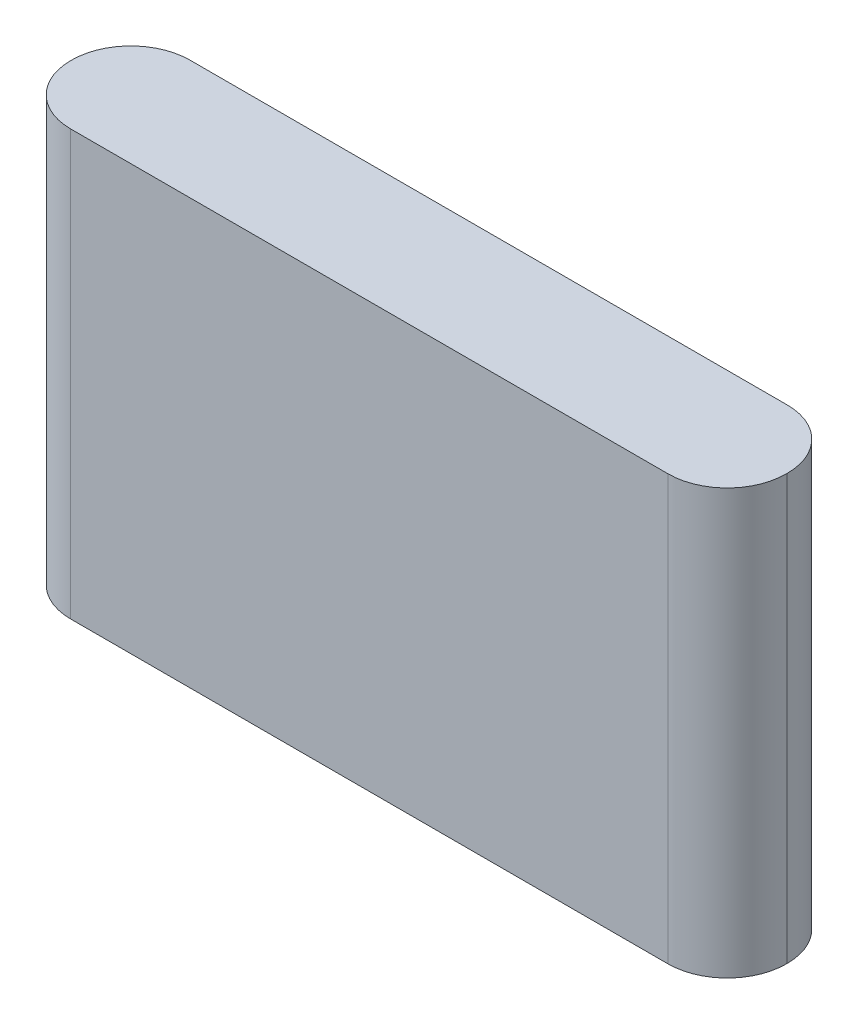
ISO-10303-21;
HEADER;
FILE_DESCRIPTION(('STEP AP214'),'2;1');
FILE_NAME('part.step','',(''),(''),'','','');
FILE_SCHEMA(('AUTOMOTIVE_DESIGN { 1 0 10303 214 1 1 1 1 }'));
ENDSEC;
DATA;
#1=APPLICATION_CONTEXT('core data for automotive mechanical design processes');
#2=APPLICATION_PROTOCOL_DEFINITION('international standard','automotive_design',2000,#1);
#3=PRODUCT_CONTEXT('',#1,'mechanical');
#4=PRODUCT('Part','Part','',(#3));
#5=PRODUCT_RELATED_PRODUCT_CATEGORY('part','',(#4));
#6=PRODUCT_DEFINITION_FORMATION('','',#4);
#7=PRODUCT_DEFINITION_CONTEXT('part definition',#1,'design');
#8=PRODUCT_DEFINITION('design','',#6,#7);
#9=PRODUCT_DEFINITION_SHAPE('','',#8);
#10=(LENGTH_UNIT() NAMED_UNIT(*) SI_UNIT(.MILLI.,.METRE.));
#11=(NAMED_UNIT(*) PLANE_ANGLE_UNIT() SI_UNIT($,.RADIAN.));
#12=(NAMED_UNIT(*) SI_UNIT($,.STERADIAN.) SOLID_ANGLE_UNIT());
#13=UNCERTAINTY_MEASURE_WITH_UNIT(LENGTH_MEASURE(1.E-05),#10,'distance_accuracy_value','');
#14=(GEOMETRIC_REPRESENTATION_CONTEXT(3) GLOBAL_UNCERTAINTY_ASSIGNED_CONTEXT((#13)) GLOBAL_UNIT_ASSIGNED_CONTEXT((#10,
#11,#12)) REPRESENTATION_CONTEXT('',''));
#15=CARTESIAN_POINT('',(0.,0.,0.));
#16=DIRECTION('',(0.,0.,1.));
#17=DIRECTION('',(1.,0.,0.));
#18=AXIS2_PLACEMENT_3D('',#15,#16,#17);
#19=CARTESIAN_POINT('',(43.,51.,-7.165));
#20=DIRECTION('',(-1.,0.,0.));
#21=DIRECTION('',(0.,0.,1.));
#22=AXIS2_PLACEMENT_3D('',#19,#20,#21);
#23=PLANE('',#22);
#24=DIRECTION('',(0.,0.,-1.));
#25=VECTOR('',#24,1.);
#26=CARTESIAN_POINT('',(43.,0.,-7.165));
#27=LINE('',#26,#25);
#28=CARTESIAN_POINT('',(43.,0.,0.0649999999999982));
#29=VERTEX_POINT('',#28);
#30=CARTESIAN_POINT('',(43.,0.,-0.0650000000000034));
#31=VERTEX_POINT('',#30);
#32=EDGE_CURVE('E131',#29,#31,#27,.T.);
#33=ORIENTED_EDGE('',*,*,#32,.T.);
#34=DIRECTION('',(0.,-1.,0.));
#35=VECTOR('',#34,1.);
#36=CARTESIAN_POINT('',(43.,51.,-0.0650000000000034));
#37=LINE('',#36,#35);
#38=CARTESIAN_POINT('',(43.,51.,-0.0650000000000034));
#39=VERTEX_POINT('',#38);
#40=EDGE_CURVE('E108',#31,#39,#37,.F.);
#41=ORIENTED_EDGE('',*,*,#40,.T.);
#42=DIRECTION('',(0.,0.,-1.));
#43=VECTOR('',#42,1.);
#44=CARTESIAN_POINT('',(43.,51.,-7.165));
#45=LINE('',#44,#43);
#46=CARTESIAN_POINT('',(43.,51.,0.0649999999999982));
#47=VERTEX_POINT('',#46);
#48=EDGE_CURVE('E140',#47,#39,#45,.T.);
#49=ORIENTED_EDGE('',*,*,#48,.F.);
#50=DIRECTION('',(0.,-1.,0.));
#51=VECTOR('',#50,1.);
#52=CARTESIAN_POINT('',(43.,51.,0.0649999999999982));
#53=LINE('',#52,#51);
#54=EDGE_CURVE('E113',#47,#29,#53,.T.);
#55=ORIENTED_EDGE('',*,*,#54,.T.);
#56=EDGE_LOOP('',(#33,#41,#49,#55));
#57=FACE_BOUND('',#56,.T.);
#58=ADVANCED_FACE('F36',(#57),#23,.F.);
#59=CARTESIAN_POINT('',(-43.,51.,-7.165));
#60=DIRECTION('',(0.,0.,1.));
#61=DIRECTION('',(1.,0.,0.));
#62=AXIS2_PLACEMENT_3D('',#59,#60,#61);
#63=PLANE('',#62);
#64=DIRECTION('',(-1.,0.,0.));
#65=VECTOR('',#64,1.);
#66=CARTESIAN_POINT('',(-43.,51.,-7.165));
#67=LINE('',#66,#65);
#68=CARTESIAN_POINT('',(35.9,51.,-7.165));
#69=VERTEX_POINT('',#68);
#70=CARTESIAN_POINT('',(-35.9,51.,-7.165));
#71=VERTEX_POINT('',#70);
#72=EDGE_CURVE('E123',#69,#71,#67,.T.);
#73=ORIENTED_EDGE('',*,*,#72,.F.);
#74=DIRECTION('',(0.,-1.,0.));
#75=VECTOR('',#74,1.);
#76=CARTESIAN_POINT('',(35.9,51.,-7.165));
#77=LINE('',#76,#75);
#78=CARTESIAN_POINT('',(35.9,0.,-7.165));
#79=VERTEX_POINT('',#78);
#80=EDGE_CURVE('E107',#69,#79,#77,.T.);
#81=ORIENTED_EDGE('',*,*,#80,.T.);
#82=DIRECTION('',(-1.,0.,0.));
#83=VECTOR('',#82,1.);
#84=CARTESIAN_POINT('',(-43.,0.,-7.165));
#85=LINE('',#84,#83);
#86=CARTESIAN_POINT('',(-35.9,0.,-7.165));
#87=VERTEX_POINT('',#86);
#88=EDGE_CURVE('E120',#79,#87,#85,.T.);
#89=ORIENTED_EDGE('',*,*,#88,.T.);
#90=DIRECTION('',(0.,-1.,0.));
#91=VECTOR('',#90,1.);
#92=CARTESIAN_POINT('',(-35.9,51.,-7.165));
#93=LINE('',#92,#91);
#94=EDGE_CURVE('E125',#87,#71,#93,.F.);
#95=ORIENTED_EDGE('',*,*,#94,.T.);
#96=EDGE_LOOP('',(#73,#81,#89,#95));
#97=FACE_BOUND('',#96,.T.);
#98=ADVANCED_FACE('F119',(#97),#63,.F.);
#99=CARTESIAN_POINT('',(-43.,51.,-7.165));
#100=DIRECTION('',(1.,0.,0.));
#101=DIRECTION('',(0.,0.,-1.));
#102=AXIS2_PLACEMENT_3D('',#99,#100,#101);
#103=PLANE('',#102);
#104=DIRECTION('',(0.,0.,1.));
#105=VECTOR('',#104,1.);
#106=CARTESIAN_POINT('',(-43.,51.,-7.165));
#107=LINE('',#106,#105);
#108=CARTESIAN_POINT('',(-43.,51.,-0.0649999999999965));
#109=VERTEX_POINT('',#108);
#110=CARTESIAN_POINT('',(-43.,51.,0.0650000000000052));
#111=VERTEX_POINT('',#110);
#112=EDGE_CURVE('E163',#109,#111,#107,.T.);
#113=ORIENTED_EDGE('',*,*,#112,.F.);
#114=DIRECTION('',(0.,-1.,0.));
#115=VECTOR('',#114,1.);
#116=CARTESIAN_POINT('',(-43.,51.,-0.0649999999999965));
#117=LINE('',#116,#115);
#118=CARTESIAN_POINT('',(-43.,0.,-0.0649999999999965));
#119=VERTEX_POINT('',#118);
#120=EDGE_CURVE('E11',#109,#119,#117,.T.);
#121=ORIENTED_EDGE('',*,*,#120,.T.);
#122=DIRECTION('',(0.,0.,1.));
#123=VECTOR('',#122,1.);
#124=CARTESIAN_POINT('',(-43.,0.,-7.165));
#125=LINE('',#124,#123);
#126=CARTESIAN_POINT('',(-43.,0.,0.0650000000000052));
#127=VERTEX_POINT('',#126);
#128=EDGE_CURVE('E130',#119,#127,#125,.T.);
#129=ORIENTED_EDGE('',*,*,#128,.T.);
#130=DIRECTION('',(0.,-1.,0.));
#131=VECTOR('',#130,1.);
#132=CARTESIAN_POINT('',(-43.,51.,0.0650000000000052));
#133=LINE('',#132,#131);
#134=EDGE_CURVE('E44',#127,#111,#133,.F.);
#135=ORIENTED_EDGE('',*,*,#134,.T.);
#136=EDGE_LOOP('',(#113,#121,#129,#135));
#137=FACE_BOUND('',#136,.T.);
#138=ADVANCED_FACE('F162',(#137),#103,.F.);
#139=CARTESIAN_POINT('',(-43.,51.,7.165));
#140=DIRECTION('',(0.,0.,-1.));
#141=DIRECTION('',(-1.,0.,0.));
#142=AXIS2_PLACEMENT_3D('',#139,#140,#141);
#143=PLANE('',#142);
#144=DIRECTION('',(1.,0.,0.));
#145=VECTOR('',#144,1.);
#146=CARTESIAN_POINT('',(-43.,0.,7.165));
#147=LINE('',#146,#145);
#148=CARTESIAN_POINT('',(-35.9,0.,7.165));
#149=VERTEX_POINT('',#148);
#150=CARTESIAN_POINT('',(35.9,0.,7.165));
#151=VERTEX_POINT('',#150);
#152=EDGE_CURVE('E134',#149,#151,#147,.T.);
#153=ORIENTED_EDGE('',*,*,#152,.T.);
#154=DIRECTION('',(0.,-1.,0.));
#155=VECTOR('',#154,1.);
#156=CARTESIAN_POINT('',(35.9,51.,7.165));
#157=LINE('',#156,#155);
#158=CARTESIAN_POINT('',(35.9,51.,7.165));
#159=VERTEX_POINT('',#158);
#160=EDGE_CURVE('E51',#151,#159,#157,.F.);
#161=ORIENTED_EDGE('',*,*,#160,.T.);
#162=DIRECTION('',(1.,0.,0.));
#163=VECTOR('',#162,1.);
#164=CARTESIAN_POINT('',(-43.,51.,7.165));
#165=LINE('',#164,#163);
#166=CARTESIAN_POINT('',(-35.9,51.,7.165));
#167=VERTEX_POINT('',#166);
#168=EDGE_CURVE('E141',#167,#159,#165,.T.);
#169=ORIENTED_EDGE('',*,*,#168,.F.);
#170=DIRECTION('',(0.,-1.,0.));
#171=VECTOR('',#170,1.);
#172=CARTESIAN_POINT('',(-35.9,51.,7.165));
#173=LINE('',#172,#171);
#174=EDGE_CURVE('E156',#167,#149,#173,.T.);
#175=ORIENTED_EDGE('',*,*,#174,.T.);
#176=EDGE_LOOP('',(#153,#161,#169,#175));
#177=FACE_BOUND('',#176,.T.);
#178=ADVANCED_FACE('F172',(#177),#143,.F.);
#179=CARTESIAN_POINT('',(0.,51.,0.));
#180=DIRECTION('',(0.,1.,0.));
#181=DIRECTION('',(0.,0.,1.));
#182=AXIS2_PLACEMENT_3D('',#179,#180,#181);
#183=PLANE('',#182);
#184=ORIENTED_EDGE('',*,*,#48,.T.);
#185=CARTESIAN_POINT('',(35.9,51.,-0.0649999999999999));
#186=DIRECTION('',(0.,1.,0.));
#187=DIRECTION('',(0.,0.,1.));
#188=AXIS2_PLACEMENT_3D('',#185,#186,#187);
#189=CIRCLE('',#188,7.1);
#190=EDGE_CURVE('E154',#39,#69,#189,.T.);
#191=ORIENTED_EDGE('',*,*,#190,.T.);
#192=ORIENTED_EDGE('',*,*,#72,.T.);
#193=CARTESIAN_POINT('',(-35.9,51.,-0.0649999999999999));
#194=DIRECTION('',(0.,1.,0.));
#195=DIRECTION('',(0.,0.,1.));
#196=AXIS2_PLACEMENT_3D('',#193,#194,#195);
#197=CIRCLE('',#196,7.1);
#198=EDGE_CURVE('E150',#71,#109,#197,.T.);
#199=ORIENTED_EDGE('',*,*,#198,.T.);
#200=ORIENTED_EDGE('',*,*,#112,.T.);
#201=CARTESIAN_POINT('',(-35.9,51.,0.0650000000000017));
#202=DIRECTION('',(0.,1.,0.));
#203=DIRECTION('',(0.,0.,1.));
#204=AXIS2_PLACEMENT_3D('',#201,#202,#203);
#205=CIRCLE('',#204,7.1);
#206=EDGE_CURVE('E58',#111,#167,#205,.T.);
#207=ORIENTED_EDGE('',*,*,#206,.T.);
#208=ORIENTED_EDGE('',*,*,#168,.T.);
#209=CARTESIAN_POINT('',(35.9,51.,0.0650000000000017));
#210=DIRECTION('',(0.,1.,0.));
#211=DIRECTION('',(0.,0.,1.));
#212=AXIS2_PLACEMENT_3D('',#209,#210,#211);
#213=CIRCLE('',#212,7.1);
#214=EDGE_CURVE('E152',#159,#47,#213,.T.);
#215=ORIENTED_EDGE('',*,*,#214,.T.);
#216=EDGE_LOOP('',(#184,#191,#192,#199,#200,#207,#208,#215));
#217=FACE_BOUND('',#216,.T.);
#218=ADVANCED_FACE('F167',(#217),#183,.T.);
#219=CARTESIAN_POINT('',(0.,0.,0.));
#220=DIRECTION('',(0.,1.,0.));
#221=DIRECTION('',(0.,0.,1.));
#222=AXIS2_PLACEMENT_3D('',#219,#220,#221);
#223=PLANE('',#222);
#224=ORIENTED_EDGE('',*,*,#88,.F.);
#225=CARTESIAN_POINT('',(35.9,0.,-0.0649999999999999));
#226=DIRECTION('',(0.,1.,0.));
#227=DIRECTION('',(0.,0.,1.));
#228=AXIS2_PLACEMENT_3D('',#225,#226,#227);
#229=CIRCLE('',#228,7.1);
#230=EDGE_CURVE('E103',#79,#31,#229,.F.);
#231=ORIENTED_EDGE('',*,*,#230,.T.);
#232=ORIENTED_EDGE('',*,*,#32,.F.);
#233=CARTESIAN_POINT('',(35.9,0.,0.0650000000000017));
#234=DIRECTION('',(0.,1.,0.));
#235=DIRECTION('',(0.,0.,1.));
#236=AXIS2_PLACEMENT_3D('',#233,#234,#235);
#237=CIRCLE('',#236,7.1);
#238=EDGE_CURVE('E114',#29,#151,#237,.F.);
#239=ORIENTED_EDGE('',*,*,#238,.T.);
#240=ORIENTED_EDGE('',*,*,#152,.F.);
#241=CARTESIAN_POINT('',(-35.9,0.,0.0650000000000017));
#242=DIRECTION('',(0.,1.,0.));
#243=DIRECTION('',(0.,0.,1.));
#244=AXIS2_PLACEMENT_3D('',#241,#242,#243);
#245=CIRCLE('',#244,7.1);
#246=EDGE_CURVE('E124',#149,#127,#245,.F.);
#247=ORIENTED_EDGE('',*,*,#246,.T.);
#248=ORIENTED_EDGE('',*,*,#128,.F.);
#249=CARTESIAN_POINT('',(-35.9,0.,-0.0649999999999999));
#250=DIRECTION('',(0.,1.,0.));
#251=DIRECTION('',(0.,0.,1.));
#252=AXIS2_PLACEMENT_3D('',#249,#250,#251);
#253=CIRCLE('',#252,7.1);
#254=EDGE_CURVE('E129',#119,#87,#253,.F.);
#255=ORIENTED_EDGE('',*,*,#254,.T.);
#256=EDGE_LOOP('',(#224,#231,#232,#239,#240,#247,#248,#255));
#257=FACE_BOUND('',#256,.T.);
#258=ADVANCED_FACE('F127',(#257),#223,.F.);
#259=CARTESIAN_POINT('',(35.9,51.,-0.0649999999999999));
#260=DIRECTION('',(0.,-1.,0.));
#261=DIRECTION('',(0.,0.,-1.));
#262=AXIS2_PLACEMENT_3D('',#259,#260,#261);
#263=CYLINDRICAL_SURFACE('',#262,7.1);
#264=ORIENTED_EDGE('',*,*,#190,.F.);
#265=ORIENTED_EDGE('',*,*,#40,.F.);
#266=ORIENTED_EDGE('',*,*,#230,.F.);
#267=ORIENTED_EDGE('',*,*,#80,.F.);
#268=EDGE_LOOP('',(#264,#265,#266,#267));
#269=FACE_BOUND('',#268,.T.);
#270=ADVANCED_FACE('F106',(#269),#263,.T.);
#271=CARTESIAN_POINT('',(35.9,51.,0.0650000000000017));
#272=DIRECTION('',(0.,-1.,0.));
#273=DIRECTION('',(0.,0.,-1.));
#274=AXIS2_PLACEMENT_3D('',#271,#272,#273);
#275=CYLINDRICAL_SURFACE('',#274,7.1);
#276=ORIENTED_EDGE('',*,*,#214,.F.);
#277=ORIENTED_EDGE('',*,*,#160,.F.);
#278=ORIENTED_EDGE('',*,*,#238,.F.);
#279=ORIENTED_EDGE('',*,*,#54,.F.);
#280=EDGE_LOOP('',(#276,#277,#278,#279));
#281=FACE_BOUND('',#280,.T.);
#282=ADVANCED_FACE('F176',(#281),#275,.T.);
#283=CARTESIAN_POINT('',(-35.9,51.,-0.0649999999999999));
#284=DIRECTION('',(0.,-1.,0.));
#285=DIRECTION('',(0.,0.,-1.));
#286=AXIS2_PLACEMENT_3D('',#283,#284,#285);
#287=CYLINDRICAL_SURFACE('',#286,7.1);
#288=ORIENTED_EDGE('',*,*,#198,.F.);
#289=ORIENTED_EDGE('',*,*,#94,.F.);
#290=ORIENTED_EDGE('',*,*,#254,.F.);
#291=ORIENTED_EDGE('',*,*,#120,.F.);
#292=EDGE_LOOP('',(#288,#289,#290,#291));
#293=FACE_BOUND('',#292,.T.);
#294=ADVANCED_FACE('F182',(#293),#287,.T.);
#295=CARTESIAN_POINT('',(-35.9,51.,0.0650000000000017));
#296=DIRECTION('',(0.,-1.,0.));
#297=DIRECTION('',(0.,0.,-1.));
#298=AXIS2_PLACEMENT_3D('',#295,#296,#297);
#299=CYLINDRICAL_SURFACE('',#298,7.1);
#300=ORIENTED_EDGE('',*,*,#206,.F.);
#301=ORIENTED_EDGE('',*,*,#134,.F.);
#302=ORIENTED_EDGE('',*,*,#246,.F.);
#303=ORIENTED_EDGE('',*,*,#174,.F.);
#304=EDGE_LOOP('',(#300,#301,#302,#303));
#305=FACE_BOUND('',#304,.T.);
#306=ADVANCED_FACE('F38',(#305),#299,.T.);
#307=CLOSED_SHELL('',(#58,#98,#138,#178,#218,#258,#270,#282,#294,#306));
#308=MANIFOLD_SOLID_BREP('B2',#307);
#309=ADVANCED_BREP_SHAPE_REPRESENTATION('',(#18,#308),#14);
#310=SHAPE_DEFINITION_REPRESENTATION(#9,#309);
ENDSEC;
END-ISO-10303-21;
